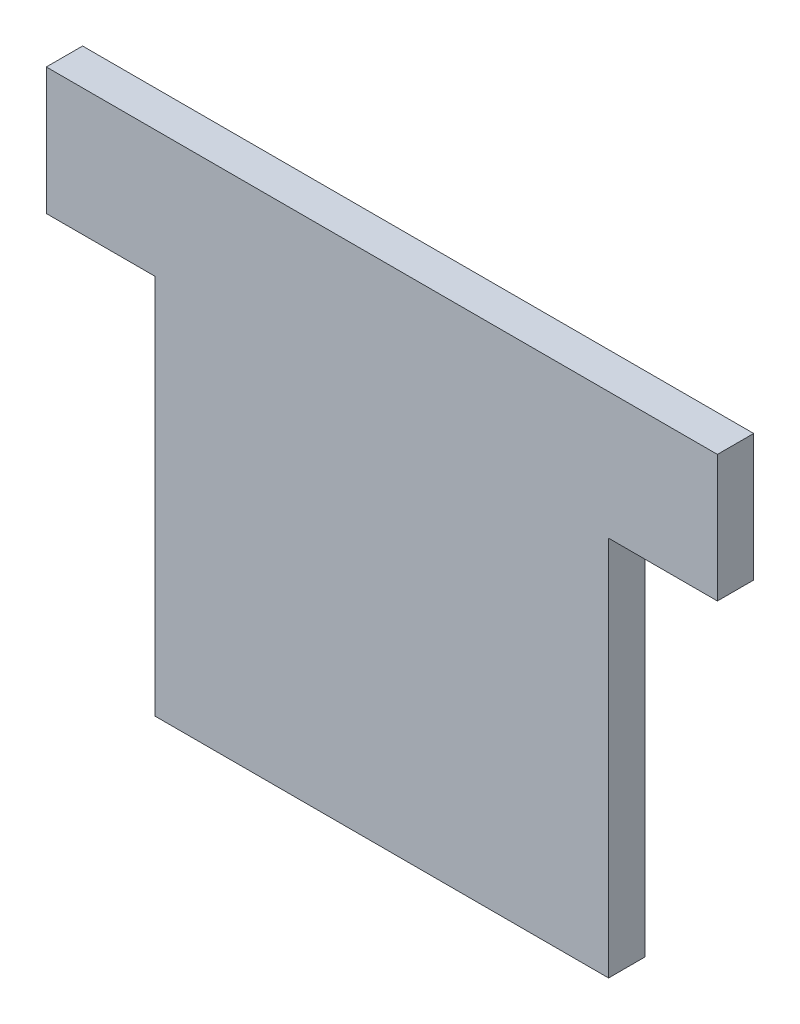
ISO-10303-21;
HEADER;
FILE_DESCRIPTION(('STEP AP214'),'2;1');
FILE_NAME('part.step','',(''),(''),'','','');
FILE_SCHEMA(('AUTOMOTIVE_DESIGN { 1 0 10303 214 1 1 1 1 }'));
ENDSEC;
DATA;
#1=APPLICATION_CONTEXT('core data for automotive mechanical design processes');
#2=APPLICATION_PROTOCOL_DEFINITION('international standard','automotive_design',2000,#1);
#3=PRODUCT_CONTEXT('',#1,'mechanical');
#4=PRODUCT('Part','Part','',(#3));
#5=PRODUCT_RELATED_PRODUCT_CATEGORY('part','',(#4));
#6=PRODUCT_DEFINITION_FORMATION('','',#4);
#7=PRODUCT_DEFINITION_CONTEXT('part definition',#1,'design');
#8=PRODUCT_DEFINITION('design','',#6,#7);
#9=PRODUCT_DEFINITION_SHAPE('','',#8);
#10=(LENGTH_UNIT() NAMED_UNIT(*) SI_UNIT(.MILLI.,.METRE.));
#11=(NAMED_UNIT(*) PLANE_ANGLE_UNIT() SI_UNIT($,.RADIAN.));
#12=(NAMED_UNIT(*) SI_UNIT($,.STERADIAN.) SOLID_ANGLE_UNIT());
#13=UNCERTAINTY_MEASURE_WITH_UNIT(LENGTH_MEASURE(1.E-05),#10,'distance_accuracy_value','');
#14=(GEOMETRIC_REPRESENTATION_CONTEXT(3) GLOBAL_UNCERTAINTY_ASSIGNED_CONTEXT((#13)) GLOBAL_UNIT_ASSIGNED_CONTEXT((#10,
#11,#12)) REPRESENTATION_CONTEXT('',''));
#15=CARTESIAN_POINT('',(0.,0.,0.));
#16=DIRECTION('',(0.,0.,1.));
#17=DIRECTION('',(1.,0.,0.));
#18=AXIS2_PLACEMENT_3D('',#15,#16,#17);
#19=CARTESIAN_POINT('',(0.,-21.,2.));
#20=DIRECTION('',(0.,1.,0.));
#21=DIRECTION('',(0.,0.,1.));
#22=AXIS2_PLACEMENT_3D('',#19,#20,#21);
#23=PLANE('',#22);
#24=DIRECTION('',(1.,0.,0.));
#25=VECTOR('',#24,1.);
#26=CARTESIAN_POINT('',(0.,-21.,0.));
#27=LINE('',#26,#25);
#28=CARTESIAN_POINT('',(0.,-21.,0.));
#29=VERTEX_POINT('',#28);
#30=CARTESIAN_POINT('',(25.,-21.,0.));
#31=VERTEX_POINT('',#30);
#32=EDGE_CURVE('E131',#29,#31,#27,.T.);
#33=ORIENTED_EDGE('',*,*,#32,.T.);
#34=DIRECTION('',(0.,0.,-1.));
#35=VECTOR('',#34,1.);
#36=CARTESIAN_POINT('',(25.,-21.,2.));
#37=LINE('',#36,#35);
#38=CARTESIAN_POINT('',(25.,-21.,2.));
#39=VERTEX_POINT('',#38);
#40=EDGE_CURVE('E11',#39,#31,#37,.T.);
#41=ORIENTED_EDGE('',*,*,#40,.F.);
#42=DIRECTION('',(1.,0.,0.));
#43=VECTOR('',#42,1.);
#44=CARTESIAN_POINT('',(0.,-21.,2.));
#45=LINE('',#44,#43);
#46=CARTESIAN_POINT('',(0.,-21.,2.));
#47=VERTEX_POINT('',#46);
#48=EDGE_CURVE('E145',#47,#39,#45,.T.);
#49=ORIENTED_EDGE('',*,*,#48,.F.);
#50=DIRECTION('',(0.,0.,-1.));
#51=VECTOR('',#50,1.);
#52=CARTESIAN_POINT('',(0.,-21.,2.));
#53=LINE('',#52,#51);
#54=EDGE_CURVE('E127',#47,#29,#53,.T.);
#55=ORIENTED_EDGE('',*,*,#54,.T.);
#56=EDGE_LOOP('',(#33,#41,#49,#55));
#57=FACE_BOUND('',#56,.T.);
#58=ADVANCED_FACE('F35',(#57),#23,.F.);
#59=CARTESIAN_POINT('',(25.,-21.,2.));
#60=DIRECTION('',(-1.,0.,0.));
#61=DIRECTION('',(0.,-1.,0.));
#62=AXIS2_PLACEMENT_3D('',#59,#60,#61);
#63=PLANE('',#62);
#64=DIRECTION('',(0.,1.,0.));
#65=VECTOR('',#64,1.);
#66=CARTESIAN_POINT('',(25.,-21.,0.));
#67=LINE('',#66,#65);
#68=CARTESIAN_POINT('',(25.,0.,0.));
#69=VERTEX_POINT('',#68);
#70=EDGE_CURVE('E134',#31,#69,#67,.T.);
#71=ORIENTED_EDGE('',*,*,#70,.T.);
#72=DIRECTION('',(0.,0.,-1.));
#73=VECTOR('',#72,1.);
#74=CARTESIAN_POINT('',(25.,0.,2.));
#75=LINE('',#74,#73);
#76=CARTESIAN_POINT('',(25.,0.,2.));
#77=VERTEX_POINT('',#76);
#78=EDGE_CURVE('E43',#77,#69,#75,.T.);
#79=ORIENTED_EDGE('',*,*,#78,.F.);
#80=DIRECTION('',(0.,1.,0.));
#81=VECTOR('',#80,1.);
#82=CARTESIAN_POINT('',(25.,-21.,2.));
#83=LINE('',#82,#81);
#84=EDGE_CURVE('E94',#39,#77,#83,.T.);
#85=ORIENTED_EDGE('',*,*,#84,.F.);
#86=ORIENTED_EDGE('',*,*,#40,.T.);
#87=EDGE_LOOP('',(#71,#79,#85,#86));
#88=FACE_BOUND('',#87,.T.);
#89=ADVANCED_FACE('F180',(#88),#63,.F.);
#90=CARTESIAN_POINT('',(25.,0.,2.));
#91=DIRECTION('',(0.,1.,0.));
#92=DIRECTION('',(0.,0.,1.));
#93=AXIS2_PLACEMENT_3D('',#90,#91,#92);
#94=PLANE('',#93);
#95=DIRECTION('',(1.,0.,0.));
#96=VECTOR('',#95,1.);
#97=CARTESIAN_POINT('',(25.,0.,0.));
#98=LINE('',#97,#96);
#99=CARTESIAN_POINT('',(31.,0.,0.));
#100=VERTEX_POINT('',#99);
#101=EDGE_CURVE('E136',#69,#100,#98,.T.);
#102=ORIENTED_EDGE('',*,*,#101,.T.);
#103=DIRECTION('',(0.,0.,-1.));
#104=VECTOR('',#103,1.);
#105=CARTESIAN_POINT('',(31.,0.,2.));
#106=LINE('',#105,#104);
#107=CARTESIAN_POINT('',(31.,0.,2.));
#108=VERTEX_POINT('',#107);
#109=EDGE_CURVE('E152',#108,#100,#106,.T.);
#110=ORIENTED_EDGE('',*,*,#109,.F.);
#111=DIRECTION('',(1.,0.,0.));
#112=VECTOR('',#111,1.);
#113=CARTESIAN_POINT('',(25.,0.,2.));
#114=LINE('',#113,#112);
#115=EDGE_CURVE('E160',#77,#108,#114,.T.);
#116=ORIENTED_EDGE('',*,*,#115,.F.);
#117=ORIENTED_EDGE('',*,*,#78,.T.);
#118=EDGE_LOOP('',(#102,#110,#116,#117));
#119=FACE_BOUND('',#118,.T.);
#120=ADVANCED_FACE('F158',(#119),#94,.F.);
#121=CARTESIAN_POINT('',(31.,0.,2.));
#122=DIRECTION('',(-1.,0.,0.));
#123=DIRECTION('',(0.,0.,1.));
#124=AXIS2_PLACEMENT_3D('',#121,#122,#123);
#125=PLANE('',#124);
#126=DIRECTION('',(0.,1.,0.));
#127=VECTOR('',#126,1.);
#128=CARTESIAN_POINT('',(31.,0.,0.));
#129=LINE('',#128,#127);
#130=CARTESIAN_POINT('',(31.,7.,0.));
#131=VERTEX_POINT('',#130);
#132=EDGE_CURVE('E138',#100,#131,#129,.T.);
#133=ORIENTED_EDGE('',*,*,#132,.T.);
#134=DIRECTION('',(0.,0.,-1.));
#135=VECTOR('',#134,1.);
#136=CARTESIAN_POINT('',(31.,7.,2.));
#137=LINE('',#136,#135);
#138=CARTESIAN_POINT('',(31.,7.,2.));
#139=VERTEX_POINT('',#138);
#140=EDGE_CURVE('E149',#139,#131,#137,.T.);
#141=ORIENTED_EDGE('',*,*,#140,.F.);
#142=DIRECTION('',(0.,1.,0.));
#143=VECTOR('',#142,1.);
#144=CARTESIAN_POINT('',(31.,0.,2.));
#145=LINE('',#144,#143);
#146=EDGE_CURVE('E172',#108,#139,#145,.T.);
#147=ORIENTED_EDGE('',*,*,#146,.F.);
#148=ORIENTED_EDGE('',*,*,#109,.T.);
#149=EDGE_LOOP('',(#133,#141,#147,#148));
#150=FACE_BOUND('',#149,.T.);
#151=ADVANCED_FACE('F168',(#150),#125,.F.);
#152=CARTESIAN_POINT('',(31.,7.,2.));
#153=DIRECTION('',(0.,-1.,0.));
#154=DIRECTION('',(1.,0.,0.));
#155=AXIS2_PLACEMENT_3D('',#152,#153,#154);
#156=PLANE('',#155);
#157=DIRECTION('',(-1.,0.,0.));
#158=VECTOR('',#157,1.);
#159=CARTESIAN_POINT('',(31.,7.,0.));
#160=LINE('',#159,#158);
#161=CARTESIAN_POINT('',(-6.,7.,0.));
#162=VERTEX_POINT('',#161);
#163=EDGE_CURVE('E140',#131,#162,#160,.T.);
#164=ORIENTED_EDGE('',*,*,#163,.T.);
#165=DIRECTION('',(0.,0.,-1.));
#166=VECTOR('',#165,1.);
#167=CARTESIAN_POINT('',(-6.,7.,2.));
#168=LINE('',#167,#166);
#169=CARTESIAN_POINT('',(-6.,7.,2.));
#170=VERTEX_POINT('',#169);
#171=EDGE_CURVE('E122',#170,#162,#168,.T.);
#172=ORIENTED_EDGE('',*,*,#171,.F.);
#173=DIRECTION('',(-1.,0.,0.));
#174=VECTOR('',#173,1.);
#175=CARTESIAN_POINT('',(31.,7.,2.));
#176=LINE('',#175,#174);
#177=EDGE_CURVE('E113',#139,#170,#176,.T.);
#178=ORIENTED_EDGE('',*,*,#177,.F.);
#179=ORIENTED_EDGE('',*,*,#140,.T.);
#180=EDGE_LOOP('',(#164,#172,#178,#179));
#181=FACE_BOUND('',#180,.T.);
#182=ADVANCED_FACE('F171',(#181),#156,.F.);
#183=CARTESIAN_POINT('',(-6.,7.,2.));
#184=DIRECTION('',(1.,0.,0.));
#185=DIRECTION('',(0.,1.,0.));
#186=AXIS2_PLACEMENT_3D('',#183,#184,#185);
#187=PLANE('',#186);
#188=DIRECTION('',(0.,-1.,0.));
#189=VECTOR('',#188,1.);
#190=CARTESIAN_POINT('',(-6.,7.,0.));
#191=LINE('',#190,#189);
#192=CARTESIAN_POINT('',(-6.,0.,0.));
#193=VERTEX_POINT('',#192);
#194=EDGE_CURVE('E121',#162,#193,#191,.T.);
#195=ORIENTED_EDGE('',*,*,#194,.T.);
#196=DIRECTION('',(0.,0.,-1.));
#197=VECTOR('',#196,1.);
#198=CARTESIAN_POINT('',(-6.,0.,2.));
#199=LINE('',#198,#197);
#200=CARTESIAN_POINT('',(-6.,0.,2.));
#201=VERTEX_POINT('',#200);
#202=EDGE_CURVE('E118',#201,#193,#199,.T.);
#203=ORIENTED_EDGE('',*,*,#202,.F.);
#204=DIRECTION('',(0.,-1.,0.));
#205=VECTOR('',#204,1.);
#206=CARTESIAN_POINT('',(-6.,7.,2.));
#207=LINE('',#206,#205);
#208=EDGE_CURVE('E107',#170,#201,#207,.T.);
#209=ORIENTED_EDGE('',*,*,#208,.F.);
#210=ORIENTED_EDGE('',*,*,#171,.T.);
#211=EDGE_LOOP('',(#195,#203,#209,#210));
#212=FACE_BOUND('',#211,.T.);
#213=ADVANCED_FACE('F119',(#212),#187,.F.);
#214=CARTESIAN_POINT('',(-6.,0.,2.));
#215=DIRECTION('',(0.,1.,0.));
#216=DIRECTION('',(0.,0.,1.));
#217=AXIS2_PLACEMENT_3D('',#214,#215,#216);
#218=PLANE('',#217);
#219=DIRECTION('',(1.,0.,0.));
#220=VECTOR('',#219,1.);
#221=CARTESIAN_POINT('',(-6.,0.,0.));
#222=LINE('',#221,#220);
#223=CARTESIAN_POINT('',(0.,0.,0.));
#224=VERTEX_POINT('',#223);
#225=EDGE_CURVE('E80',#193,#224,#222,.T.);
#226=ORIENTED_EDGE('',*,*,#225,.T.);
#227=DIRECTION('',(0.,0.,-1.));
#228=VECTOR('',#227,1.);
#229=CARTESIAN_POINT('',(0.,0.,2.));
#230=LINE('',#229,#228);
#231=CARTESIAN_POINT('',(0.,0.,2.));
#232=VERTEX_POINT('',#231);
#233=EDGE_CURVE('E123',#232,#224,#230,.T.);
#234=ORIENTED_EDGE('',*,*,#233,.F.);
#235=DIRECTION('',(1.,0.,0.));
#236=VECTOR('',#235,1.);
#237=CARTESIAN_POINT('',(-6.,0.,2.));
#238=LINE('',#237,#236);
#239=EDGE_CURVE('E111',#201,#232,#238,.T.);
#240=ORIENTED_EDGE('',*,*,#239,.F.);
#241=ORIENTED_EDGE('',*,*,#202,.T.);
#242=EDGE_LOOP('',(#226,#234,#240,#241));
#243=FACE_BOUND('',#242,.T.);
#244=ADVANCED_FACE('F125',(#243),#218,.F.);
#245=CARTESIAN_POINT('',(0.,0.,2.));
#246=DIRECTION('',(1.,0.,0.));
#247=DIRECTION('',(0.,1.,0.));
#248=AXIS2_PLACEMENT_3D('',#245,#246,#247);
#249=PLANE('',#248);
#250=DIRECTION('',(0.,-1.,0.));
#251=VECTOR('',#250,1.);
#252=CARTESIAN_POINT('',(0.,0.,0.));
#253=LINE('',#252,#251);
#254=EDGE_CURVE('E86',#224,#29,#253,.T.);
#255=ORIENTED_EDGE('',*,*,#254,.T.);
#256=ORIENTED_EDGE('',*,*,#54,.F.);
#257=DIRECTION('',(0.,-1.,0.));
#258=VECTOR('',#257,1.);
#259=CARTESIAN_POINT('',(0.,0.,2.));
#260=LINE('',#259,#258);
#261=EDGE_CURVE('E51',#232,#47,#260,.T.);
#262=ORIENTED_EDGE('',*,*,#261,.F.);
#263=ORIENTED_EDGE('',*,*,#233,.T.);
#264=EDGE_LOOP('',(#255,#256,#262,#263));
#265=FACE_BOUND('',#264,.T.);
#266=ADVANCED_FACE('F196',(#265),#249,.F.);
#267=CARTESIAN_POINT('',(0.,0.,2.));
#268=DIRECTION('',(0.,0.,1.));
#269=DIRECTION('',(1.,0.,0.));
#270=AXIS2_PLACEMENT_3D('',#267,#268,#269);
#271=PLANE('',#270);
#272=ORIENTED_EDGE('',*,*,#48,.T.);
#273=ORIENTED_EDGE('',*,*,#84,.T.);
#274=ORIENTED_EDGE('',*,*,#115,.T.);
#275=ORIENTED_EDGE('',*,*,#146,.T.);
#276=ORIENTED_EDGE('',*,*,#177,.T.);
#277=ORIENTED_EDGE('',*,*,#208,.T.);
#278=ORIENTED_EDGE('',*,*,#239,.T.);
#279=ORIENTED_EDGE('',*,*,#261,.T.);
#280=EDGE_LOOP('',(#272,#273,#274,#275,#276,#277,#278,#279));
#281=FACE_BOUND('',#280,.T.);
#282=ADVANCED_FACE('F109',(#281),#271,.T.);
#283=CARTESIAN_POINT('',(0.,0.,0.));
#284=DIRECTION('',(0.,0.,1.));
#285=DIRECTION('',(1.,0.,0.));
#286=AXIS2_PLACEMENT_3D('',#283,#284,#285);
#287=PLANE('',#286);
#288=ORIENTED_EDGE('',*,*,#32,.F.);
#289=ORIENTED_EDGE('',*,*,#254,.F.);
#290=ORIENTED_EDGE('',*,*,#225,.F.);
#291=ORIENTED_EDGE('',*,*,#194,.F.);
#292=ORIENTED_EDGE('',*,*,#163,.F.);
#293=ORIENTED_EDGE('',*,*,#132,.F.);
#294=ORIENTED_EDGE('',*,*,#101,.F.);
#295=ORIENTED_EDGE('',*,*,#70,.F.);
#296=EDGE_LOOP('',(#288,#289,#290,#291,#292,#293,#294,#295));
#297=FACE_BOUND('',#296,.T.);
#298=ADVANCED_FACE('F164',(#297),#287,.F.);
#299=CLOSED_SHELL('',(#58,#89,#120,#151,#182,#213,#244,#266,#282,#298));
#300=MANIFOLD_SOLID_BREP('B2',#299);
#301=ADVANCED_BREP_SHAPE_REPRESENTATION('',(#18,#300),#14);
#302=SHAPE_DEFINITION_REPRESENTATION(#9,#301);
ENDSEC;
END-ISO-10303-21;
